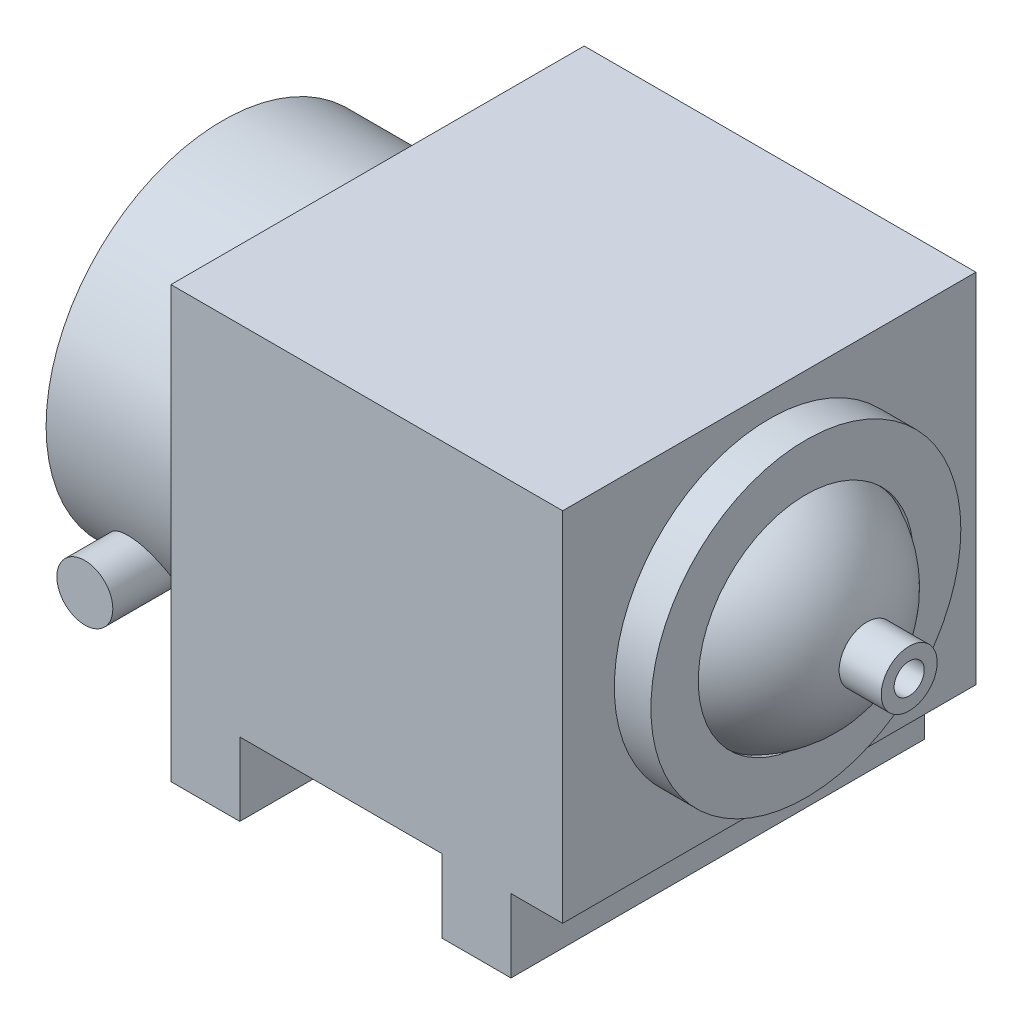
ISO-10303-21;
HEADER;
FILE_DESCRIPTION(('STEP AP214'),'2;1');
FILE_NAME('part.step','',(''),(''),'','','');
FILE_SCHEMA(('AUTOMOTIVE_DESIGN { 1 0 10303 214 1 1 1 1 }'));
ENDSEC;
DATA;
#1=APPLICATION_CONTEXT('core data for automotive mechanical design processes');
#2=APPLICATION_PROTOCOL_DEFINITION('international standard','automotive_design',2000,#1);
#3=PRODUCT_CONTEXT('',#1,'mechanical');
#4=PRODUCT('Part','Part','',(#3));
#5=PRODUCT_RELATED_PRODUCT_CATEGORY('part','',(#4));
#6=PRODUCT_DEFINITION_FORMATION('','',#4);
#7=PRODUCT_DEFINITION_CONTEXT('part definition',#1,'design');
#8=PRODUCT_DEFINITION('design','',#6,#7);
#9=PRODUCT_DEFINITION_SHAPE('','',#8);
#10=(LENGTH_UNIT() NAMED_UNIT(*) SI_UNIT(.MILLI.,.METRE.));
#11=(NAMED_UNIT(*) PLANE_ANGLE_UNIT() SI_UNIT($,.RADIAN.));
#12=(NAMED_UNIT(*) SI_UNIT($,.STERADIAN.) SOLID_ANGLE_UNIT());
#13=UNCERTAINTY_MEASURE_WITH_UNIT(LENGTH_MEASURE(1.E-05),#10,'distance_accuracy_value','');
#14=(GEOMETRIC_REPRESENTATION_CONTEXT(3) GLOBAL_UNCERTAINTY_ASSIGNED_CONTEXT((#13)) GLOBAL_UNIT_ASSIGNED_CONTEXT((#10,
#11,#12)) REPRESENTATION_CONTEXT('',''));
#15=CARTESIAN_POINT('',(0.,0.,0.));
#16=DIRECTION('',(0.,0.,1.));
#17=DIRECTION('',(1.,0.,0.));
#18=AXIS2_PLACEMENT_3D('',#15,#16,#17);
#19=CARTESIAN_POINT('',(47.46875,58.5,0.));
#20=DIRECTION('',(0.,0.,1.));
#21=DIRECTION('',(1.,0.,0.));
#22=AXIS2_PLACEMENT_3D('',#19,#20,#21);
#23=SPHERICAL_SURFACE('',#22,27.53125);
#24=CARTESIAN_POINT('',(47.46875,58.5,0.));
#25=DIRECTION('',(1.,0.,0.));
#26=DIRECTION('',(0.,0.,-1.));
#27=AXIS2_PLACEMENT_3D('',#24,#25,#26);
#28=SPHERICAL_SURFACE('',#27,27.53125);
#29=CARTESIAN_POINT('',(59.,58.5,0.));
#30=DIRECTION('',(1.,0.,0.));
#31=DIRECTION('',(0.,0.,-1.));
#32=AXIS2_PLACEMENT_3D('',#29,#30,#31);
#33=CIRCLE('',#32,25.);
#34=CARTESIAN_POINT('',(59.,58.5,-25.));
#35=VERTEX_POINT('',#34);
#36=EDGE_CURVE('E200',#35,#35,#33,.T.);
#37=ORIENTED_EDGE('',*,*,#36,.T.);
#38=EDGE_LOOP('',(#37));
#39=FACE_BOUND('',#38,.T.);
#40=CARTESIAN_POINT('',(74.2216886528378,58.5,0.));
#41=DIRECTION('',(-1.,0.,0.));
#42=DIRECTION('',(0.,0.,1.));
#43=AXIS2_PLACEMENT_3D('',#40,#41,#42);
#44=CIRCLE('',#43,6.5);
#45=CARTESIAN_POINT('',(74.2216886528378,58.5,6.5));
#46=VERTEX_POINT('',#45);
#47=EDGE_CURVE('E37',#46,#46,#44,.T.);
#48=ORIENTED_EDGE('',*,*,#47,.T.);
#49=EDGE_LOOP('',(#48));
#50=FACE_BOUND('',#49,.T.);
#51=ADVANCED_FACE('F33',(#39,#50),#28,.T.);
#52=CARTESIAN_POINT('',(0.,0.,0.));
#53=DIRECTION('',(0.,-1.,0.));
#54=DIRECTION('',(0.,0.,-1.));
#55=AXIS2_PLACEMENT_3D('',#52,#53,#54);
#56=PLANE('',#55);
#57=CARTESIAN_POINT('',(32.,0.,-40.5));
#58=DIRECTION('',(0.,1.,0.));
#59=DIRECTION('',(0.,0.,1.));
#60=AXIS2_PLACEMENT_3D('',#57,#58,#59);
#61=CIRCLE('',#60,2.99999999999999);
#62=CARTESIAN_POINT('',(32.,0.,-37.5));
#63=VERTEX_POINT('',#62);
#64=EDGE_CURVE('E173',#63,#63,#61,.T.);
#65=ORIENTED_EDGE('',*,*,#64,.T.);
#66=EDGE_LOOP('',(#65));
#67=FACE_BOUND('',#66,.T.);
#68=DIRECTION('',(1.,0.,0.));
#69=VECTOR('',#68,1.);
#70=CARTESIAN_POINT('',(23.5,0.,48.));
#71=LINE('',#70,#69);
#72=CARTESIAN_POINT('',(23.5,0.,48.));
#73=VERTEX_POINT('',#72);
#74=CARTESIAN_POINT('',(39.5,0.,48.));
#75=VERTEX_POINT('',#74);
#76=EDGE_CURVE('E178',#73,#75,#71,.T.);
#77=ORIENTED_EDGE('',*,*,#76,.F.);
#78=DIRECTION('',(0.,0.,1.));
#79=VECTOR('',#78,1.);
#80=CARTESIAN_POINT('',(23.5,0.,48.));
#81=LINE('',#80,#79);
#82=CARTESIAN_POINT('',(23.5,0.,-48.));
#83=VERTEX_POINT('',#82);
#84=EDGE_CURVE('E72',#83,#73,#81,.T.);
#85=ORIENTED_EDGE('',*,*,#84,.F.);
#86=DIRECTION('',(-1.,0.,0.));
#87=VECTOR('',#86,1.);
#88=CARTESIAN_POINT('',(23.5,0.,-48.));
#89=LINE('',#88,#87);
#90=CARTESIAN_POINT('',(39.5,0.,-48.));
#91=VERTEX_POINT('',#90);
#92=EDGE_CURVE('E67',#91,#83,#89,.T.);
#93=ORIENTED_EDGE('',*,*,#92,.F.);
#94=DIRECTION('',(0.,0.,-1.));
#95=VECTOR('',#94,1.);
#96=CARTESIAN_POINT('',(39.5,0.,-48.));
#97=LINE('',#96,#95);
#98=EDGE_CURVE('E183',#75,#91,#97,.T.);
#99=ORIENTED_EDGE('',*,*,#98,.F.);
#100=EDGE_LOOP('',(#77,#85,#93,#99));
#101=FACE_BOUND('',#100,.T.);
#102=CARTESIAN_POINT('',(32.,0.,40.5));
#103=DIRECTION('',(0.,1.,0.));
#104=DIRECTION('',(0.,0.,1.));
#105=AXIS2_PLACEMENT_3D('',#102,#103,#104);
#106=CIRCLE('',#105,2.99999999999999);
#107=CARTESIAN_POINT('',(32.,0.,43.5));
#108=VERTEX_POINT('',#107);
#109=EDGE_CURVE('E170',#108,#108,#106,.T.);
#110=ORIENTED_EDGE('',*,*,#109,.T.);
#111=EDGE_LOOP('',(#110));
#112=FACE_BOUND('',#111,.T.);
#113=ADVANCED_FACE('F287',(#67,#101,#112),#56,.T.);
#114=CARTESIAN_POINT('',(23.5,17.,48.));
#115=DIRECTION('',(0.,0.,-1.));
#116=DIRECTION('',(-1.,0.,0.));
#117=AXIS2_PLACEMENT_3D('',#114,#115,#116);
#118=PLANE('',#117);
#119=ORIENTED_EDGE('',*,*,#76,.T.);
#120=DIRECTION('',(0.,-1.,0.));
#121=VECTOR('',#120,1.);
#122=CARTESIAN_POINT('',(39.5,17.,48.));
#123=LINE('',#122,#121);
#124=CARTESIAN_POINT('',(39.5,17.,48.));
#125=VERTEX_POINT('',#124);
#126=EDGE_CURVE('E191',#125,#75,#123,.T.);
#127=ORIENTED_EDGE('',*,*,#126,.F.);
#128=DIRECTION('',(1.,0.,0.));
#129=VECTOR('',#128,1.);
#130=CARTESIAN_POINT('',(-39.5,17.,48.));
#131=LINE('',#130,#129);
#132=CARTESIAN_POINT('',(51.5,17.,48.));
#133=VERTEX_POINT('',#132);
#134=EDGE_CURVE('E130',#125,#133,#131,.T.);
#135=ORIENTED_EDGE('',*,*,#134,.T.);
#136=DIRECTION('',(0.,-1.,0.));
#137=VECTOR('',#136,1.);
#138=CARTESIAN_POINT('',(51.5,100.,48.));
#139=LINE('',#138,#137);
#140=CARTESIAN_POINT('',(51.5,100.,48.));
#141=VERTEX_POINT('',#140);
#142=EDGE_CURVE('E161',#141,#133,#139,.T.);
#143=ORIENTED_EDGE('',*,*,#142,.F.);
#144=DIRECTION('',(1.,0.,0.));
#145=VECTOR('',#144,1.);
#146=CARTESIAN_POINT('',(-39.5,100.,48.));
#147=LINE('',#146,#145);
#148=CARTESIAN_POINT('',(-39.5,100.,48.));
#149=VERTEX_POINT('',#148);
#150=EDGE_CURVE('E378',#149,#141,#147,.T.);
#151=ORIENTED_EDGE('',*,*,#150,.F.);
#152=DIRECTION('',(0.,-1.,0.));
#153=VECTOR('',#152,1.);
#154=CARTESIAN_POINT('',(-39.5,100.,48.));
#155=LINE('',#154,#153);
#156=CARTESIAN_POINT('',(-39.5,0.,48.));
#157=VERTEX_POINT('',#156);
#158=EDGE_CURVE('E164',#149,#157,#155,.T.);
#159=ORIENTED_EDGE('',*,*,#158,.T.);
#160=DIRECTION('',(1.,0.,0.));
#161=VECTOR('',#160,1.);
#162=CARTESIAN_POINT('',(-39.5,0.,48.));
#163=LINE('',#162,#161);
#164=CARTESIAN_POINT('',(-23.5,0.,48.));
#165=VERTEX_POINT('',#164);
#166=EDGE_CURVE('E127',#157,#165,#163,.T.);
#167=ORIENTED_EDGE('',*,*,#166,.T.);
#168=DIRECTION('',(0.,-1.,0.));
#169=VECTOR('',#168,1.);
#170=CARTESIAN_POINT('',(-23.5,17.,48.));
#171=LINE('',#170,#169);
#172=CARTESIAN_POINT('',(-23.5,17.,48.));
#173=VERTEX_POINT('',#172);
#174=EDGE_CURVE('E120',#173,#165,#171,.T.);
#175=ORIENTED_EDGE('',*,*,#174,.F.);
#176=CARTESIAN_POINT('',(23.5,17.,48.));
#177=VERTEX_POINT('',#176);
#178=EDGE_CURVE('E125',#173,#177,#131,.T.);
#179=ORIENTED_EDGE('',*,*,#178,.T.);
#180=DIRECTION('',(0.,-1.,0.));
#181=VECTOR('',#180,1.);
#182=CARTESIAN_POINT('',(23.5,17.,48.));
#183=LINE('',#182,#181);
#184=EDGE_CURVE('E181',#177,#73,#183,.T.);
#185=ORIENTED_EDGE('',*,*,#184,.T.);
#186=EDGE_LOOP('',(#119,#127,#135,#143,#151,#159,#167,#175,#179,#185));
#187=FACE_BOUND('',#186,.T.);
#188=ADVANCED_FACE('F123',(#187),#118,.F.);
#189=CARTESIAN_POINT('',(39.5,17.,-48.));
#190=DIRECTION('',(-1.,0.,0.));
#191=DIRECTION('',(0.,0.,1.));
#192=AXIS2_PLACEMENT_3D('',#189,#190,#191);
#193=PLANE('',#192);
#194=ORIENTED_EDGE('',*,*,#98,.T.);
#195=DIRECTION('',(0.,-1.,0.));
#196=VECTOR('',#195,1.);
#197=CARTESIAN_POINT('',(39.5,17.,-48.));
#198=LINE('',#197,#196);
#199=CARTESIAN_POINT('',(39.5,17.,-48.));
#200=VERTEX_POINT('',#199);
#201=EDGE_CURVE('E189',#200,#91,#198,.T.);
#202=ORIENTED_EDGE('',*,*,#201,.F.);
#203=DIRECTION('',(0.,0.,-1.));
#204=VECTOR('',#203,1.);
#205=CARTESIAN_POINT('',(39.5,17.,-48.));
#206=LINE('',#205,#204);
#207=EDGE_CURVE('E78',#125,#200,#206,.T.);
#208=ORIENTED_EDGE('',*,*,#207,.F.);
#209=ORIENTED_EDGE('',*,*,#126,.T.);
#210=EDGE_LOOP('',(#194,#202,#208,#209));
#211=FACE_BOUND('',#210,.T.);
#212=ADVANCED_FACE('F296',(#211),#193,.F.);
#213=CARTESIAN_POINT('',(23.5,17.,-48.));
#214=DIRECTION('',(0.,0.,1.));
#215=DIRECTION('',(1.,0.,0.));
#216=AXIS2_PLACEMENT_3D('',#213,#214,#215);
#217=PLANE('',#216);
#218=ORIENTED_EDGE('',*,*,#92,.T.);
#219=DIRECTION('',(0.,-1.,0.));
#220=VECTOR('',#219,1.);
#221=CARTESIAN_POINT('',(23.5,17.,-48.));
#222=LINE('',#221,#220);
#223=CARTESIAN_POINT('',(23.5,17.,-48.));
#224=VERTEX_POINT('',#223);
#225=EDGE_CURVE('E51',#224,#83,#222,.T.);
#226=ORIENTED_EDGE('',*,*,#225,.F.);
#227=DIRECTION('',(-1.,0.,0.));
#228=VECTOR('',#227,1.);
#229=CARTESIAN_POINT('',(-39.5,17.,-48.));
#230=LINE('',#229,#228);
#231=CARTESIAN_POINT('',(-23.5,17.,-48.));
#232=VERTEX_POINT('',#231);
#233=EDGE_CURVE('E146',#224,#232,#230,.T.);
#234=ORIENTED_EDGE('',*,*,#233,.T.);
#235=DIRECTION('',(0.,-1.,0.));
#236=VECTOR('',#235,1.);
#237=CARTESIAN_POINT('',(-23.5,17.,-48.));
#238=LINE('',#237,#236);
#239=CARTESIAN_POINT('',(-23.5,0.,-48.));
#240=VERTEX_POINT('',#239);
#241=EDGE_CURVE('E131',#232,#240,#238,.T.);
#242=ORIENTED_EDGE('',*,*,#241,.T.);
#243=DIRECTION('',(-1.,0.,0.));
#244=VECTOR('',#243,1.);
#245=CARTESIAN_POINT('',(-39.5,0.,-48.));
#246=LINE('',#245,#244);
#247=CARTESIAN_POINT('',(-39.5,0.,-48.));
#248=VERTEX_POINT('',#247);
#249=EDGE_CURVE('E139',#240,#248,#246,.T.);
#250=ORIENTED_EDGE('',*,*,#249,.T.);
#251=DIRECTION('',(0.,-1.,0.));
#252=VECTOR('',#251,1.);
#253=CARTESIAN_POINT('',(-39.5,100.,-48.));
#254=LINE('',#253,#252);
#255=CARTESIAN_POINT('',(-39.5,100.,-48.));
#256=VERTEX_POINT('',#255);
#257=EDGE_CURVE('E156',#256,#248,#254,.T.);
#258=ORIENTED_EDGE('',*,*,#257,.F.);
#259=DIRECTION('',(-1.,0.,0.));
#260=VECTOR('',#259,1.);
#261=CARTESIAN_POINT('',(-39.5,100.,-48.));
#262=LINE('',#261,#260);
#263=CARTESIAN_POINT('',(51.5,100.,-48.));
#264=VERTEX_POINT('',#263);
#265=EDGE_CURVE('E149',#264,#256,#262,.T.);
#266=ORIENTED_EDGE('',*,*,#265,.F.);
#267=DIRECTION('',(0.,-1.,0.));
#268=VECTOR('',#267,1.);
#269=CARTESIAN_POINT('',(51.5,100.,-48.));
#270=LINE('',#269,#268);
#271=CARTESIAN_POINT('',(51.5,17.,-48.));
#272=VERTEX_POINT('',#271);
#273=EDGE_CURVE('E158',#264,#272,#270,.T.);
#274=ORIENTED_EDGE('',*,*,#273,.T.);
#275=EDGE_CURVE('E152',#272,#200,#230,.T.);
#276=ORIENTED_EDGE('',*,*,#275,.T.);
#277=ORIENTED_EDGE('',*,*,#201,.T.);
#278=EDGE_LOOP('',(#218,#226,#234,#242,#250,#258,#266,#274,#276,#277));
#279=FACE_BOUND('',#278,.T.);
#280=ADVANCED_FACE('F293',(#279),#217,.F.);
#281=CARTESIAN_POINT('',(23.5,17.,48.));
#282=DIRECTION('',(1.,0.,0.));
#283=DIRECTION('',(0.,0.,-1.));
#284=AXIS2_PLACEMENT_3D('',#281,#282,#283);
#285=PLANE('',#284);
#286=ORIENTED_EDGE('',*,*,#84,.T.);
#287=ORIENTED_EDGE('',*,*,#184,.F.);
#288=DIRECTION('',(0.,0.,1.));
#289=VECTOR('',#288,1.);
#290=CARTESIAN_POINT('',(23.5,17.,48.));
#291=LINE('',#290,#289);
#292=EDGE_CURVE('E143',#224,#177,#291,.T.);
#293=ORIENTED_EDGE('',*,*,#292,.F.);
#294=ORIENTED_EDGE('',*,*,#225,.T.);
#295=EDGE_LOOP('',(#286,#287,#293,#294));
#296=FACE_BOUND('',#295,.T.);
#297=ADVANCED_FACE('F285',(#296),#285,.F.);
#298=CARTESIAN_POINT('',(32.,17.,-40.5));
#299=DIRECTION('',(0.,-1.,0.));
#300=DIRECTION('',(0.,0.,-1.));
#301=AXIS2_PLACEMENT_3D('',#298,#299,#300);
#302=CYLINDRICAL_SURFACE('',#301,2.99999999999999);
#303=CARTESIAN_POINT('',(32.,17.,-40.5));
#304=DIRECTION('',(0.,1.,0.));
#305=DIRECTION('',(0.,0.,1.));
#306=AXIS2_PLACEMENT_3D('',#303,#304,#305);
#307=CIRCLE('',#306,2.99999999999999);
#308=CARTESIAN_POINT('',(32.,17.,-37.5));
#309=VERTEX_POINT('',#308);
#310=EDGE_CURVE('E169',#309,#309,#307,.T.);
#311=ORIENTED_EDGE('',*,*,#310,.T.);
#312=EDGE_LOOP('',(#311));
#313=FACE_BOUND('',#312,.T.);
#314=ORIENTED_EDGE('',*,*,#64,.F.);
#315=EDGE_LOOP('',(#314));
#316=FACE_BOUND('',#315,.T.);
#317=ADVANCED_FACE('F281',(#313,#316),#302,.F.);
#318=CARTESIAN_POINT('',(32.,17.,40.5));
#319=DIRECTION('',(0.,-1.,0.));
#320=DIRECTION('',(0.,0.,-1.));
#321=AXIS2_PLACEMENT_3D('',#318,#319,#320);
#322=CYLINDRICAL_SURFACE('',#321,2.99999999999999);
#323=CARTESIAN_POINT('',(32.,17.,40.5));
#324=DIRECTION('',(0.,1.,0.));
#325=DIRECTION('',(0.,0.,1.));
#326=AXIS2_PLACEMENT_3D('',#323,#324,#325);
#327=CIRCLE('',#326,2.99999999999999);
#328=CARTESIAN_POINT('',(32.,17.,43.5));
#329=VERTEX_POINT('',#328);
#330=EDGE_CURVE('E166',#329,#329,#327,.T.);
#331=ORIENTED_EDGE('',*,*,#330,.T.);
#332=EDGE_LOOP('',(#331));
#333=FACE_BOUND('',#332,.T.);
#334=ORIENTED_EDGE('',*,*,#109,.F.);
#335=EDGE_LOOP('',(#334));
#336=FACE_BOUND('',#335,.T.);
#337=ADVANCED_FACE('F278',(#333,#336),#322,.F.);
#338=CARTESIAN_POINT('',(0.,17.,0.));
#339=DIRECTION('',(0.,-1.,0.));
#340=DIRECTION('',(0.,0.,-1.));
#341=AXIS2_PLACEMENT_3D('',#338,#339,#340);
#342=PLANE('',#341);
#343=ORIENTED_EDGE('',*,*,#330,.F.);
#344=EDGE_LOOP('',(#343));
#345=FACE_BOUND('',#344,.T.);
#346=ADVANCED_FACE('F269',(#345),#342,.T.);
#347=ORIENTED_EDGE('',*,*,#310,.F.);
#348=EDGE_LOOP('',(#347));
#349=FACE_BOUND('',#348,.T.);
#350=ADVANCED_FACE('F402',(#349),#342,.T.);
#351=ORIENTED_EDGE('',*,*,#134,.F.);
#352=ORIENTED_EDGE('',*,*,#207,.T.);
#353=ORIENTED_EDGE('',*,*,#275,.F.);
#354=DIRECTION('',(0.,0.,-1.));
#355=VECTOR('',#354,1.);
#356=CARTESIAN_POINT('',(51.5,17.,48.));
#357=LINE('',#356,#355);
#358=EDGE_CURVE('E144',#133,#272,#357,.T.);
#359=ORIENTED_EDGE('',*,*,#358,.F.);
#360=EDGE_LOOP('',(#351,#352,#353,#359));
#361=FACE_BOUND('',#360,.T.);
#362=ADVANCED_FACE('F276',(#361),#342,.T.);
#363=CARTESIAN_POINT('',(-39.5,100.,48.));
#364=DIRECTION('',(1.,0.,0.));
#365=DIRECTION('',(0.,0.,-1.));
#366=AXIS2_PLACEMENT_3D('',#363,#364,#365);
#367=PLANE('',#366);
#368=CARTESIAN_POINT('',(-39.5,50.,0.));
#369=DIRECTION('',(-1.,0.,0.));
#370=DIRECTION('',(0.,0.,1.));
#371=AXIS2_PLACEMENT_3D('',#368,#369,#370);
#372=CIRCLE('',#371,41.);
#373=CARTESIAN_POINT('',(-39.5,50.,41.));
#374=VERTEX_POINT('',#373);
#375=EDGE_CURVE('E199',#374,#374,#372,.T.);
#376=ORIENTED_EDGE('',*,*,#375,.F.);
#377=EDGE_LOOP('',(#376));
#378=FACE_BOUND('',#377,.T.);
#379=ORIENTED_EDGE('',*,*,#257,.T.);
#380=DIRECTION('',(0.,0.,1.));
#381=VECTOR('',#380,1.);
#382=CARTESIAN_POINT('',(-39.5,0.,-48.));
#383=LINE('',#382,#381);
#384=EDGE_CURVE('E366',#248,#157,#383,.T.);
#385=ORIENTED_EDGE('',*,*,#384,.T.);
#386=ORIENTED_EDGE('',*,*,#158,.F.);
#387=DIRECTION('',(0.,0.,1.));
#388=VECTOR('',#387,1.);
#389=CARTESIAN_POINT('',(-39.5,100.,48.));
#390=LINE('',#389,#388);
#391=EDGE_CURVE('E155',#256,#149,#390,.T.);
#392=ORIENTED_EDGE('',*,*,#391,.F.);
#393=EDGE_LOOP('',(#379,#385,#386,#392));
#394=FACE_BOUND('',#393,.T.);
#395=ADVANCED_FACE('F272',(#378,#394),#367,.F.);
#396=CARTESIAN_POINT('',(51.5,100.,48.));
#397=DIRECTION('',(-1.,0.,0.));
#398=DIRECTION('',(0.,0.,1.));
#399=AXIS2_PLACEMENT_3D('',#396,#397,#398);
#400=PLANE('',#399);
#401=CARTESIAN_POINT('',(51.5,58.5,0.));
#402=DIRECTION('',(1.,0.,0.));
#403=DIRECTION('',(0.,0.,-1.));
#404=AXIS2_PLACEMENT_3D('',#401,#402,#403);
#405=CIRCLE('',#404,36.);
#406=CARTESIAN_POINT('',(51.5,58.5,-36.));
#407=VERTEX_POINT('',#406);
#408=EDGE_CURVE('E43',#407,#407,#405,.T.);
#409=ORIENTED_EDGE('',*,*,#408,.F.);
#410=EDGE_LOOP('',(#409));
#411=FACE_BOUND('',#410,.T.);
#412=ORIENTED_EDGE('',*,*,#358,.T.);
#413=ORIENTED_EDGE('',*,*,#273,.F.);
#414=DIRECTION('',(0.,0.,-1.));
#415=VECTOR('',#414,1.);
#416=CARTESIAN_POINT('',(51.5,100.,48.));
#417=LINE('',#416,#415);
#418=EDGE_CURVE('E379',#141,#264,#417,.T.);
#419=ORIENTED_EDGE('',*,*,#418,.F.);
#420=ORIENTED_EDGE('',*,*,#142,.T.);
#421=EDGE_LOOP('',(#412,#413,#419,#420));
#422=FACE_BOUND('',#421,.T.);
#423=ADVANCED_FACE('F265',(#411,#422),#400,.F.);
#424=CARTESIAN_POINT('',(0.,100.,0.));
#425=DIRECTION('',(0.,-1.,0.));
#426=DIRECTION('',(0.,0.,-1.));
#427=AXIS2_PLACEMENT_3D('',#424,#425,#426);
#428=PLANE('',#427);
#429=ORIENTED_EDGE('',*,*,#391,.T.);
#430=ORIENTED_EDGE('',*,*,#150,.T.);
#431=ORIENTED_EDGE('',*,*,#418,.T.);
#432=ORIENTED_EDGE('',*,*,#265,.T.);
#433=EDGE_LOOP('',(#429,#430,#431,#432));
#434=FACE_BOUND('',#433,.T.);
#435=ADVANCED_FACE('F262',(#434),#428,.F.);
#436=ORIENTED_EDGE('',*,*,#178,.F.);
#437=DIRECTION('',(0.,0.,-1.));
#438=VECTOR('',#437,1.);
#439=CARTESIAN_POINT('',(-23.5,17.,-48.));
#440=LINE('',#439,#438);
#441=EDGE_CURVE('E134',#173,#232,#440,.T.);
#442=ORIENTED_EDGE('',*,*,#441,.T.);
#443=ORIENTED_EDGE('',*,*,#233,.F.);
#444=ORIENTED_EDGE('',*,*,#292,.T.);
#445=EDGE_LOOP('',(#436,#442,#443,#444));
#446=FACE_BOUND('',#445,.T.);
#447=ADVANCED_FACE('F142',(#446),#342,.T.);
#448=CARTESIAN_POINT('',(0.,0.,0.));
#449=DIRECTION('',(0.,1.,0.));
#450=DIRECTION('',(0.,0.,1.));
#451=AXIS2_PLACEMENT_3D('',#448,#449,#450);
#452=PLANE('',#451);
#453=ORIENTED_EDGE('',*,*,#384,.F.);
#454=ORIENTED_EDGE('',*,*,#249,.F.);
#455=DIRECTION('',(0.,0.,-1.));
#456=VECTOR('',#455,1.);
#457=CARTESIAN_POINT('',(-23.5,0.,-48.));
#458=LINE('',#457,#456);
#459=EDGE_CURVE('E371',#165,#240,#458,.T.);
#460=ORIENTED_EDGE('',*,*,#459,.F.);
#461=ORIENTED_EDGE('',*,*,#166,.F.);
#462=EDGE_LOOP('',(#453,#454,#460,#461));
#463=FACE_BOUND('',#462,.T.);
#464=CARTESIAN_POINT('',(-32.,0.,-40.5));
#465=DIRECTION('',(0.,1.,0.));
#466=DIRECTION('',(0.,0.,1.));
#467=AXIS2_PLACEMENT_3D('',#464,#465,#466);
#468=CIRCLE('',#467,3.);
#469=CARTESIAN_POINT('',(-32.,0.,-37.5));
#470=VERTEX_POINT('',#469);
#471=EDGE_CURVE('E364',#470,#470,#468,.T.);
#472=ORIENTED_EDGE('',*,*,#471,.T.);
#473=EDGE_LOOP('',(#472));
#474=FACE_BOUND('',#473,.T.);
#475=CARTESIAN_POINT('',(-32.,0.,40.5));
#476=DIRECTION('',(0.,1.,0.));
#477=DIRECTION('',(0.,0.,1.));
#478=AXIS2_PLACEMENT_3D('',#475,#476,#477);
#479=CIRCLE('',#478,2.99999999999999);
#480=CARTESIAN_POINT('',(-32.,0.,43.5));
#481=VERTEX_POINT('',#480);
#482=EDGE_CURVE('E361',#481,#481,#479,.T.);
#483=ORIENTED_EDGE('',*,*,#482,.T.);
#484=EDGE_LOOP('',(#483));
#485=FACE_BOUND('',#484,.T.);
#486=ADVANCED_FACE('F256',(#463,#474,#485),#452,.F.);
#487=CARTESIAN_POINT('',(-23.5,17.,-48.));
#488=DIRECTION('',(-1.,0.,0.));
#489=DIRECTION('',(0.,0.,1.));
#490=AXIS2_PLACEMENT_3D('',#487,#488,#489);
#491=PLANE('',#490);
#492=ORIENTED_EDGE('',*,*,#459,.T.);
#493=ORIENTED_EDGE('',*,*,#241,.F.);
#494=ORIENTED_EDGE('',*,*,#441,.F.);
#495=ORIENTED_EDGE('',*,*,#174,.T.);
#496=EDGE_LOOP('',(#492,#493,#494,#495));
#497=FACE_BOUND('',#496,.T.);
#498=ADVANCED_FACE('F135',(#497),#491,.F.);
#499=CARTESIAN_POINT('',(-32.,17.,-40.5));
#500=DIRECTION('',(0.,-1.,0.));
#501=DIRECTION('',(0.,0.,-1.));
#502=AXIS2_PLACEMENT_3D('',#499,#500,#501);
#503=CYLINDRICAL_SURFACE('',#502,3.);
#504=CARTESIAN_POINT('',(-32.,17.,-40.5));
#505=DIRECTION('',(0.,-1.,0.));
#506=DIRECTION('',(0.,0.,-1.));
#507=AXIS2_PLACEMENT_3D('',#504,#505,#506);
#508=CIRCLE('',#507,3.);
#509=CARTESIAN_POINT('',(-32.,17.,-43.5));
#510=VERTEX_POINT('',#509);
#511=EDGE_CURVE('E196',#510,#510,#508,.F.);
#512=ORIENTED_EDGE('',*,*,#511,.T.);
#513=EDGE_LOOP('',(#512));
#514=FACE_BOUND('',#513,.T.);
#515=ORIENTED_EDGE('',*,*,#471,.F.);
#516=EDGE_LOOP('',(#515));
#517=FACE_BOUND('',#516,.T.);
#518=ADVANCED_FACE('F251',(#514,#517),#503,.F.);
#519=CARTESIAN_POINT('',(-32.,17.,40.5));
#520=DIRECTION('',(0.,-1.,0.));
#521=DIRECTION('',(0.,0.,-1.));
#522=AXIS2_PLACEMENT_3D('',#519,#520,#521);
#523=CYLINDRICAL_SURFACE('',#522,2.99999999999999);
#524=CARTESIAN_POINT('',(-32.,17.,40.5));
#525=DIRECTION('',(0.,-1.,0.));
#526=DIRECTION('',(0.,0.,-1.));
#527=AXIS2_PLACEMENT_3D('',#524,#525,#526);
#528=CIRCLE('',#527,2.99999999999999);
#529=CARTESIAN_POINT('',(-32.,17.,37.5));
#530=VERTEX_POINT('',#529);
#531=EDGE_CURVE('E193',#530,#530,#528,.F.);
#532=ORIENTED_EDGE('',*,*,#531,.T.);
#533=EDGE_LOOP('',(#532));
#534=FACE_BOUND('',#533,.T.);
#535=ORIENTED_EDGE('',*,*,#482,.F.);
#536=EDGE_LOOP('',(#535));
#537=FACE_BOUND('',#536,.T.);
#538=ADVANCED_FACE('F247',(#534,#537),#523,.F.);
#539=ORIENTED_EDGE('',*,*,#531,.F.);
#540=EDGE_LOOP('',(#539));
#541=FACE_BOUND('',#540,.T.);
#542=ADVANCED_FACE('F250',(#541),#342,.T.);
#543=ORIENTED_EDGE('',*,*,#511,.F.);
#544=EDGE_LOOP('',(#543));
#545=FACE_BOUND('',#544,.T.);
#546=ADVANCED_FACE('F245',(#545),#342,.T.);
#547=CARTESIAN_POINT('',(-75.5,50.,0.));
#548=DIRECTION('',(1.,0.,0.));
#549=DIRECTION('',(0.,0.,-1.));
#550=AXIS2_PLACEMENT_3D('',#547,#548,#549);
#551=CYLINDRICAL_SURFACE('',#550,41.);
#552=CARTESIAN_POINT('',(-53.,28.,34.5976877840124));
#553=CARTESIAN_POINT('',(-53.000000469284,28.1936269053041,34.7208107303923));
#554=CARTESIAN_POINT('',(-53.0086545099493,28.3883444351911,34.8423404504152));
#555=CARTESIAN_POINT('',(-53.0438293676719,28.778628685334,35.0814166593694));
#556=CARTESIAN_POINT('',(-53.0703526115214,28.9741955173478,35.198962604992));
#557=CARTESIAN_POINT('',(-53.141879228148,29.365245797567,35.4296282791066));
#558=CARTESIAN_POINT('',(-53.1869271504804,29.5607278996213,35.5427366123913));
#559=CARTESIAN_POINT('',(-53.295922886037,29.9493941506098,35.7634327113673));
#560=CARTESIAN_POINT('',(-53.3598599410834,30.1425795426457,35.8710235786698));
#561=CARTESIAN_POINT('',(-53.5074239990105,30.5261678949954,36.0807142303422));
#562=CARTESIAN_POINT('',(-53.5911736512392,30.7165453426874,36.1827747366887));
#563=CARTESIAN_POINT('',(-53.7782143257903,31.0911102934116,36.379921133852));
#564=CARTESIAN_POINT('',(-53.8814961421089,31.2753006646008,36.4750102812656));
#565=CARTESIAN_POINT('',(-54.1073873946606,31.6352213319213,36.6575448596786));
#566=CARTESIAN_POINT('',(-54.2299814672516,31.8109582092846,36.7449962815422));
#567=CARTESIAN_POINT('',(-54.4940768592214,32.1517688819414,36.9117410973486));
#568=CARTESIAN_POINT('',(-54.6355749050805,32.3168445160714,36.9910358995396));
#569=CARTESIAN_POINT('',(-54.9181120595518,32.6144425532064,37.1317394849983));
#570=CARTESIAN_POINT('',(-55.0570693730091,32.7484721551548,37.1941487141272));
#571=CARTESIAN_POINT('',(-55.3480525018555,33.0048898302218,37.3120106601611));
#572=CARTESIAN_POINT('',(-55.5000765287742,33.1272794917101,37.3674643265424));
#573=CARTESIAN_POINT('',(-55.8160797496596,33.3588325460044,37.4711574782731));
#574=CARTESIAN_POINT('',(-55.9800537007305,33.4680016838736,37.5194000993792));
#575=CARTESIAN_POINT('',(-56.3187295920747,33.6717332611403,37.6085106962819));
#576=CARTESIAN_POINT('',(-56.4934305689642,33.7662970095601,37.6493793330344));
#577=CARTESIAN_POINT('',(-56.8331231750485,33.9303882704231,37.7196856501122));
#578=CARTESIAN_POINT('',(-56.9971943051631,34.0015046567923,37.7498744564152));
#579=CARTESIAN_POINT('',(-57.3315195187013,34.1302341081903,37.8041719333482));
#580=CARTESIAN_POINT('',(-57.5017731114113,34.1878482422245,37.8282810853304));
#581=CARTESIAN_POINT('',(-57.8471183486429,34.2889064011571,37.8703648879262));
#582=CARTESIAN_POINT('',(-58.0222085225229,34.3323546830714,37.8883413815558));
#583=CARTESIAN_POINT('',(-58.3759009313902,34.4046059271504,37.9181383422526));
#584=CARTESIAN_POINT('',(-58.5545030863882,34.4334092224718,37.9299589493594));
#585=CARTESIAN_POINT('',(-58.9043658766264,34.4749215916957,37.9469684336607));
#586=CARTESIAN_POINT('',(-59.0755210634593,34.4883946230962,37.9524722362029));
#587=CARTESIAN_POINT('',(-59.4184469226322,34.5017528587861,37.9579292040047));
#588=CARTESIAN_POINT('',(-59.5902175761435,34.5016384752563,37.9578825376404));
#589=CARTESIAN_POINT('',(-59.9330970832031,34.4878242452546,37.9522391718552));
#590=CARTESIAN_POINT('',(-60.1042060181087,34.4741261258813,37.9466431780014));
#591=CARTESIAN_POINT('',(-60.4445388101189,34.433289938422,37.9299093544057));
#592=CARTESIAN_POINT('',(-60.6137626628955,34.4061518394858,37.9187715119431));
#593=CARTESIAN_POINT('',(-60.9468663966698,34.3391682422377,37.8911551700743));
#594=CARTESIAN_POINT('',(-61.1107874467081,34.2994970057032,37.8747498616856));
#595=CARTESIAN_POINT('',(-61.4345330687638,34.207729003517,37.8365781306826));
#596=CARTESIAN_POINT('',(-61.5943562404854,34.15562805153,37.8148099017528));
#597=CARTESIAN_POINT('',(-61.9087456451382,34.0395379337631,37.7659583766314));
#598=CARTESIAN_POINT('',(-62.0633129571515,33.9755512258998,37.7388761792776));
#599=CARTESIAN_POINT('',(-62.3662375149313,33.8363064464262,37.6794471480134));
#600=CARTESIAN_POINT('',(-62.5145944616905,33.76104783291,37.6471000609828));
#601=CARTESIAN_POINT('',(-62.806735898731,33.5985644389503,37.5766002681342));
#602=CARTESIAN_POINT('',(-62.9503939055629,33.5111523155082,37.5383553779287));
#603=CARTESIAN_POINT('',(-63.2294867543731,33.326251142387,37.4565923891479));
#604=CARTESIAN_POINT('',(-63.3649213642591,33.2287618085043,37.4130741418443));
#605=CARTESIAN_POINT('',(-63.6268205991485,33.0246308199624,37.3208973241709));
#606=CARTESIAN_POINT('',(-63.7532860015662,32.9179899602951,37.272239200217));
#607=CARTESIAN_POINT('',(-63.9966916786627,32.696472614422,37.1699183180607));
#608=CARTESIAN_POINT('',(-64.113628566553,32.5815932269786,37.116253794809));
#609=CARTESIAN_POINT('',(-64.3431613537038,32.3385633583189,37.001251763079));
#610=CARTESIAN_POINT('',(-64.4552306755095,32.2100347543665,36.9396623742566));
#611=CARTESIAN_POINT('',(-64.6678733239411,31.9461141789773,36.8113941653976));
#612=CARTESIAN_POINT('',(-64.7684424260219,31.8107197115965,36.7447134900087));
#613=CARTESIAN_POINT('',(-64.957750971505,31.5342632843823,36.6065627667047));
#614=CARTESIAN_POINT('',(-65.0464918827096,31.3932020305931,36.5350933147031));
#615=CARTESIAN_POINT('',(-65.2120401134653,31.1064485215163,36.3876314787188));
#616=CARTESIAN_POINT('',(-65.2888429323047,30.9607545444867,36.3116374037949));
#617=CARTESIAN_POINT('',(-65.4368878052146,30.6523959487778,36.1483516211248));
#618=CARTESIAN_POINT('',(-65.5069882356401,30.4893932932306,36.0606610825854));
#619=CARTESIAN_POINT('',(-65.6329980009738,30.1604168319309,35.8807217014788));
#620=CARTESIAN_POINT('',(-65.6889020609048,29.9944419462311,35.7884711797143));
#621=CARTESIAN_POINT('',(-65.835547612299,29.4938587712137,35.505556515488));
#622=CARTESIAN_POINT('',(-65.9052972071586,29.1564334427981,35.3086457188078));
#623=CARTESIAN_POINT('',(-65.99641059503,28.4397637365355,34.8762531958956));
#624=CARTESIAN_POINT('',(-66.0104872449372,28.0606620818201,34.6390519183833));
#625=CARTESIAN_POINT('',(-65.9743927505643,27.3125272344827,34.153736719458));
#626=CARTESIAN_POINT('',(-65.9241787410407,26.9435009271214,33.9056156238997));
#627=CARTESIAN_POINT('',(-65.752499520998,26.1747867141687,33.3707428849648));
#628=CARTESIAN_POINT('',(-65.6224554148602,25.7775377154662,33.0832380133348));
#629=CARTESIAN_POINT('',(-65.288300620708,25.0134421564523,32.5099959198927));
#630=CARTESIAN_POINT('',(-65.0841584776996,24.6466085890076,32.2242595012673));
#631=CARTESIAN_POINT('',(-64.7367925317551,24.1449476490221,31.8206867509585));
#632=CARTESIAN_POINT('',(-64.622374799706,23.9940708000536,31.6974412231766));
#633=CARTESIAN_POINT('',(-64.3791386215535,23.7011276196034,31.4548171025958));
#634=CARTESIAN_POINT('',(-64.2503196018344,23.559061639417,31.335438664071));
#635=CARTESIAN_POINT('',(-63.8423131715815,23.1478798050672,30.9853544037261));
#636=CARTESIAN_POINT('',(-63.5411065572725,22.8930911468946,30.7621408534896));
#637=CARTESIAN_POINT('',(-63.0891150984889,22.5786965649177,30.4809032562295));
#638=CARTESIAN_POINT('',(-62.962730040299,22.4970407724529,30.4072092494593));
#639=CARTESIAN_POINT('',(-62.7020927473533,22.3414119687141,30.2657147283755));
#640=CARTESIAN_POINT('',(-62.5678408519421,22.2674386264307,30.1979139601638));
#641=CARTESIAN_POINT('',(-62.2918882415738,22.1280977944272,30.0693543538793));
#642=CARTESIAN_POINT('',(-62.1501945753219,22.0627223595367,30.0085890207915));
#643=CARTESIAN_POINT('',(-61.8597388202094,21.9414213811025,29.8952011914223));
#644=CARTESIAN_POINT('',(-61.7109806361502,21.8854906932506,29.8425742636874));
#645=CARTESIAN_POINT('',(-61.4324995488454,21.7924847743329,29.7546545943641));
#646=CARTESIAN_POINT('',(-61.3037564321689,21.7538204821673,29.7179348405385));
#647=CARTESIAN_POINT('',(-61.0424558431242,21.684218547528,29.6516244570942));
#648=CARTESIAN_POINT('',(-60.9099003072092,21.6532770570703,29.6220302773284));
#649=CARTESIAN_POINT('',(-60.6417058686487,21.599593621903,29.5705648154712));
#650=CARTESIAN_POINT('',(-60.5060680893404,21.5768487392819,29.5486907663103));
#651=CARTESIAN_POINT('',(-60.2325575096124,21.5399381123353,29.5131417646906));
#652=CARTESIAN_POINT('',(-60.0946846898568,21.5257724422718,29.4994668832043));
#653=CARTESIAN_POINT('',(-59.8172494052407,21.506252525818,29.480612980936));
#654=CARTESIAN_POINT('',(-59.6776827318484,21.5009290935311,29.4754636709138));
#655=CARTESIAN_POINT('',(-59.3984467344774,21.4992938197509,29.4738824838196));
#656=CARTESIAN_POINT('',(-59.258777410394,21.5029819874636,29.4774506156532));
#657=CARTESIAN_POINT('',(-58.9804339615966,21.5192986187348,29.4932157590848));
#658=CARTESIAN_POINT('',(-58.8417599994587,21.5319285106562,29.5054141492916));
#659=CARTESIAN_POINT('',(-58.5664862444523,21.5658887290513,29.5381426297413));
#660=CARTESIAN_POINT('',(-58.4298864439318,21.587219023419,29.5586726892392));
#661=CARTESIAN_POINT('',(-58.1663496353294,21.6369457751918,29.6063891360418));
#662=CARTESIAN_POINT('',(-58.0392681520501,21.6649422784301,29.6331977056545));
#663=CARTESIAN_POINT('',(-57.7884710386625,21.7280453327205,29.6934080325199));
#664=CARTESIAN_POINT('',(-57.6647564501907,21.7631540563851,29.7268118043691));
#665=CARTESIAN_POINT('',(-57.2994762304421,21.8784981124636,29.8360913097314));
#666=CARTESIAN_POINT('',(-57.0636644432301,21.9687725640047,29.9210558284039));
#667=CARTESIAN_POINT('',(-56.6746906502407,22.1434227418962,30.0835675440959));
#668=CARTESIAN_POINT('',(-56.5169699658439,22.2222866228008,30.1564530360256));
#669=CARTESIAN_POINT('',(-56.2114923287072,22.3905357285453,30.3105673314134));
#670=CARTESIAN_POINT('',(-56.0637363824455,22.4799220136941,30.3917969755798));
#671=CARTESIAN_POINT('',(-55.7782410348741,22.6682250165441,30.561252380798));
#672=CARTESIAN_POINT('',(-55.6405209637932,22.7671593154372,30.649490992829));
#673=CARTESIAN_POINT('',(-55.3754725036977,22.973423562279,30.8315276515594));
#674=CARTESIAN_POINT('',(-55.2481442733009,23.0807536383292,30.9253257830799));
#675=CARTESIAN_POINT('',(-54.9677439842661,23.3358353570543,31.1457619399905));
#676=CARTESIAN_POINT('',(-54.818189142605,23.4861566079615,31.2739108542251));
#677=CARTESIAN_POINT('',(-54.5364308560824,23.79795877616,31.5356068097497));
#678=CARTESIAN_POINT('',(-54.4042318905832,23.9594425580273,31.6691552330076));
#679=CARTESIAN_POINT('',(-54.1570586897553,24.2924385938073,31.9400594745938));
#680=CARTESIAN_POINT('',(-54.0421016995904,24.4639606526751,32.0774189441378));
#681=CARTESIAN_POINT('',(-53.8296571870629,24.8157529156068,32.3543476332604));
#682=CARTESIAN_POINT('',(-53.7321676468185,24.9960221061195,32.493916595563));
#683=CARTESIAN_POINT('',(-53.5536451314913,25.3667955072155,32.7759090084983));
#684=CARTESIAN_POINT('',(-53.4728512940737,25.557404813038,32.9183455960324));
#685=CARTESIAN_POINT('',(-53.3297287331895,25.9456021906951,33.203070528551));
#686=CARTESIAN_POINT('',(-53.267403305374,26.1431915010653,33.3453588425677));
#687=CARTESIAN_POINT('',(-53.1618665082276,26.5436917055076,33.6282850757277));
#688=CARTESIAN_POINT('',(-53.1186024559992,26.7465862691229,33.7689264845661));
#689=CARTESIAN_POINT('',(-53.0515461517325,27.1570088817551,34.0478963550414));
#690=CARTESIAN_POINT('',(-53.0277419875916,27.3645340161784,34.1862261808006));
#691=CARTESIAN_POINT('',(-53.0093475227486,27.6444015566872,34.3690902872238));
#692=CARTESIAN_POINT('',(-53.0058498394418,27.7152784174739,34.4150886865003));
#693=CARTESIAN_POINT('',(-53.0011756940382,27.8573873884658,34.5066928953005));
#694=CARTESIAN_POINT('',(-52.9999998269988,27.9286195850517,34.5522986012));
#695=CARTESIAN_POINT('',(-53.,28.,34.5976877840124));
#696=B_SPLINE_CURVE_WITH_KNOTS('',3,(#552,#553,#554,#555,#556,#557,#558,#559,#560,#561,#562,
#563,#564,#565,#566,#567,#568,#569,#570,#571,#572,#573,#574,#575,#576,#577,#578,#579,#580,#581,
#582,#583,#584,#585,#586,#587,#588,#589,#590,#591,#592,#593,#594,#595,#596,#597,#598,#599,#600,
#601,#602,#603,#604,#605,#606,#607,#608,#609,#610,#611,#612,#613,#614,#615,#616,#617,#618,#619,
#620,#621,#622,#623,#624,#625,#626,#627,#628,#629,#630,#631,#632,#633,#634,#635,#636,#637,#638,
#639,#640,#641,#642,#643,#644,#645,#646,#647,#648,#649,#650,#651,#652,#653,#654,#655,#656,#657,
#658,#659,#660,#661,#662,#663,#664,#665,#666,#667,#668,#669,#670,#671,#672,#673,#674,#675,#676,
#677,#678,#679,#680,#681,#682,#683,#684,#685,#686,#687,#688,#689,#690,#691,#692,#693,#694,#695),
.UNSPECIFIED.,.T.,.F.,(4,2,2,2,2,2,2,2,2,2,2,2,2,2,2,2,2,2,2,2,2,2,2,2,2,2,2,2,2,2,2,2,2,2,2,2,
2,2,2,2,2,2,2,2,2,2,2,2,2,2,2,2,2,2,2,2,2,2,2,2,2,2,2,2,2,2,2,2,2,2,2,4),(0.,0.688301301547966,
1.37669609920822,2.06675617361524,2.7564239841651,3.45047835630601,4.14420641466019,
4.83738534711566,5.53044439996434,6.13830723215875,6.74608699688356,7.35360169199937,
7.96106190638238,8.50442679758617,9.04774865475654,9.59090708609511,10.134053160654,
10.6487505415451,11.1634323088483,11.6780486455338,12.1926661634757,12.7004219139379,
13.2083489188528,13.7161710036324,14.2240175102098,14.7408048717829,15.2576068120786,
15.7743639032031,16.2913038750135,16.8346406321826,17.3781763443952,17.9216445444006,
18.4653171398703,19.0584525297134,19.6518079907768,20.8379424099079,22.1750236454257,
23.5129968327669,25.0287060518546,26.5450594511679,27.2222681119804,27.8995037562168,
29.2509930373317,29.7533108313618,30.2556069733082,30.7574356413246,31.2589900884635,
31.6766221902082,32.0940457841646,32.5113196117492,32.9285970512238,33.3473256232008,
33.7660546229453,34.1848505261185,34.6036448838834,35.0018041325942,35.4000851932985,
36.1963098546558,36.7680646080663,37.3398770247667,37.9127631991325,38.4856581162118,
39.2279150344975,39.9703631461705,40.7135489610671,41.4566488659169,42.2097497256692,
42.9629848939605,43.7141249651334,44.4648048912239,44.7184816489476,44.9722234129693),.UNSPECIFIED.);
#697=CARTESIAN_POINT('',(-53.,28.,34.5976877840124));
#698=VERTEX_POINT('',#697);
#699=EDGE_CURVE('E222',#698,#698,#696,.T.);
#700=ORIENTED_EDGE('',*,*,#699,.F.);
#701=EDGE_LOOP('',(#700));
#702=FACE_BOUND('',#701,.T.);
#703=CARTESIAN_POINT('',(-75.5,50.,0.));
#704=DIRECTION('',(-1.,0.,0.));
#705=DIRECTION('',(0.,0.,1.));
#706=AXIS2_PLACEMENT_3D('',#703,#704,#705);
#707=CIRCLE('',#706,41.);
#708=CARTESIAN_POINT('',(-75.5,50.,41.));
#709=VERTEX_POINT('',#708);
#710=EDGE_CURVE('E230',#709,#709,#707,.T.);
#711=ORIENTED_EDGE('',*,*,#710,.F.);
#712=EDGE_LOOP('',(#711));
#713=FACE_BOUND('',#712,.T.);
#714=ORIENTED_EDGE('',*,*,#375,.T.);
#715=EDGE_LOOP('',(#714));
#716=FACE_BOUND('',#715,.T.);
#717=ADVANCED_FACE('F241',(#702,#713,#716),#551,.T.);
#718=CARTESIAN_POINT('',(-75.5,50.,0.));
#719=DIRECTION('',(-1.,0.,0.));
#720=DIRECTION('',(0.,0.,1.));
#721=AXIS2_PLACEMENT_3D('',#718,#719,#720);
#722=PLANE('',#721);
#723=ORIENTED_EDGE('',*,*,#710,.T.);
#724=EDGE_LOOP('',(#723));
#725=FACE_BOUND('',#724,.T.);
#726=ADVANCED_FACE('F237',(#725),#722,.T.);
#727=CARTESIAN_POINT('',(-59.5,28.,48.));
#728=DIRECTION('',(0.,0.,1.));
#729=DIRECTION('',(1.,0.,0.));
#730=AXIS2_PLACEMENT_3D('',#727,#728,#729);
#731=PLANE('',#730);
#732=CARTESIAN_POINT('',(-59.5,28.,48.));
#733=DIRECTION('',(0.,0.,1.));
#734=DIRECTION('',(1.,0.,0.));
#735=AXIS2_PLACEMENT_3D('',#732,#733,#734);
#736=CIRCLE('',#735,6.5);
#737=CARTESIAN_POINT('',(-53.,28.,48.));
#738=VERTEX_POINT('',#737);
#739=EDGE_CURVE('E207',#738,#738,#736,.T.);
#740=ORIENTED_EDGE('',*,*,#739,.T.);
#741=EDGE_LOOP('',(#740));
#742=FACE_BOUND('',#741,.T.);
#743=ADVANCED_FACE('F240',(#742),#731,.T.);
#744=CARTESIAN_POINT('',(-59.5,28.,-48.002));
#745=DIRECTION('',(0.,0.,1.));
#746=DIRECTION('',(1.,0.,0.));
#747=AXIS2_PLACEMENT_3D('',#744,#745,#746);
#748=CYLINDRICAL_SURFACE('',#747,6.5);
#749=ORIENTED_EDGE('',*,*,#739,.F.);
#750=EDGE_LOOP('',(#749));
#751=FACE_BOUND('',#750,.T.);
#752=ORIENTED_EDGE('',*,*,#699,.T.);
#753=EDGE_LOOP('',(#752));
#754=FACE_BOUND('',#753,.T.);
#755=ADVANCED_FACE('F232',(#751,#754),#748,.T.);
#756=CARTESIAN_POINT('',(60.,58.5,0.));
#757=DIRECTION('',(-1.,0.,0.));
#758=DIRECTION('',(0.,0.,1.));
#759=AXIS2_PLACEMENT_3D('',#756,#757,#758);
#760=CYLINDRICAL_SURFACE('',#759,36.);
#761=CARTESIAN_POINT('',(60.,58.5,0.));
#762=DIRECTION('',(1.,0.,0.));
#763=DIRECTION('',(0.,0.,-1.));
#764=AXIS2_PLACEMENT_3D('',#761,#762,#763);
#765=CIRCLE('',#764,36.);
#766=CARTESIAN_POINT('',(60.,58.5,-36.));
#767=VERTEX_POINT('',#766);
#768=EDGE_CURVE('E202',#767,#767,#765,.T.);
#769=ORIENTED_EDGE('',*,*,#768,.F.);
#770=EDGE_LOOP('',(#769));
#771=FACE_BOUND('',#770,.T.);
#772=ORIENTED_EDGE('',*,*,#408,.T.);
#773=EDGE_LOOP('',(#772));
#774=FACE_BOUND('',#773,.T.);
#775=ADVANCED_FACE('F341',(#771,#774),#760,.T.);
#776=CARTESIAN_POINT('',(60.,58.5,0.));
#777=DIRECTION('',(1.,0.,0.));
#778=DIRECTION('',(0.,0.,-1.));
#779=AXIS2_PLACEMENT_3D('',#776,#777,#778);
#780=PLANE('',#779);
#781=CARTESIAN_POINT('',(60.,58.5,0.));
#782=DIRECTION('',(1.,0.,0.));
#783=DIRECTION('',(0.,0.,-1.));
#784=AXIS2_PLACEMENT_3D('',#781,#782,#783);
#785=CIRCLE('',#784,25.);
#786=CARTESIAN_POINT('',(60.,58.5,-25.));
#787=VERTEX_POINT('',#786);
#788=EDGE_CURVE('E203',#787,#787,#785,.T.);
#789=ORIENTED_EDGE('',*,*,#788,.F.);
#790=EDGE_LOOP('',(#789));
#791=FACE_BOUND('',#790,.T.);
#792=ORIENTED_EDGE('',*,*,#768,.T.);
#793=EDGE_LOOP('',(#792));
#794=FACE_BOUND('',#793,.T.);
#795=ADVANCED_FACE('F337',(#791,#794),#780,.T.);
#796=CARTESIAN_POINT('',(59.,58.5,0.));
#797=DIRECTION('',(1.,0.,0.));
#798=DIRECTION('',(0.,0.,-1.));
#799=AXIS2_PLACEMENT_3D('',#796,#797,#798);
#800=CYLINDRICAL_SURFACE('',#799,25.);
#801=ORIENTED_EDGE('',*,*,#36,.F.);
#802=EDGE_LOOP('',(#801));
#803=FACE_BOUND('',#802,.T.);
#804=ORIENTED_EDGE('',*,*,#788,.T.);
#805=EDGE_LOOP('',(#804));
#806=FACE_BOUND('',#805,.T.);
#807=ADVANCED_FACE('F331',(#803,#806),#800,.F.);
#808=CARTESIAN_POINT('',(84.,58.5,0.));
#809=DIRECTION('',(1.,0.,0.));
#810=DIRECTION('',(0.,0.,-1.));
#811=AXIS2_PLACEMENT_3D('',#808,#809,#810);
#812=PLANE('',#811);
#813=CARTESIAN_POINT('',(84.,58.5,0.));
#814=DIRECTION('',(1.,0.,0.));
#815=DIRECTION('',(0.,0.,-1.));
#816=AXIS2_PLACEMENT_3D('',#813,#814,#815);
#817=CIRCLE('',#816,6.5);
#818=CARTESIAN_POINT('',(84.,58.5,-6.5));
#819=VERTEX_POINT('',#818);
#820=EDGE_CURVE('E214',#819,#819,#817,.T.);
#821=ORIENTED_EDGE('',*,*,#820,.T.);
#822=EDGE_LOOP('',(#821));
#823=FACE_BOUND('',#822,.T.);
#824=CARTESIAN_POINT('',(84.,58.5,0.));
#825=DIRECTION('',(1.,0.,0.));
#826=DIRECTION('',(0.,0.,-1.));
#827=AXIS2_PLACEMENT_3D('',#824,#825,#826);
#828=CIRCLE('',#827,3.5);
#829=CARTESIAN_POINT('',(84.,58.5,-3.5));
#830=VERTEX_POINT('',#829);
#831=EDGE_CURVE('E318',#830,#830,#828,.T.);
#832=ORIENTED_EDGE('',*,*,#831,.F.);
#833=EDGE_LOOP('',(#832));
#834=FACE_BOUND('',#833,.T.);
#835=ADVANCED_FACE('F323',(#823,#834),#812,.T.);
#836=CARTESIAN_POINT('',(84.,58.5,0.));
#837=DIRECTION('',(-1.,0.,0.));
#838=DIRECTION('',(0.,0.,1.));
#839=AXIS2_PLACEMENT_3D('',#836,#837,#838);
#840=CYLINDRICAL_SURFACE('',#839,6.5);
#841=ORIENTED_EDGE('',*,*,#47,.F.);
#842=EDGE_LOOP('',(#841));
#843=FACE_BOUND('',#842,.T.);
#844=ORIENTED_EDGE('',*,*,#820,.F.);
#845=EDGE_LOOP('',(#844));
#846=FACE_BOUND('',#845,.T.);
#847=ADVANCED_FACE('F311',(#843,#846),#840,.T.);
#848=CARTESIAN_POINT('',(84.,58.5,0.));
#849=DIRECTION('',(-1.,0.,0.));
#850=DIRECTION('',(0.,0.,1.));
#851=AXIS2_PLACEMENT_3D('',#848,#849,#850);
#852=CYLINDRICAL_SURFACE('',#851,3.5);
#853=CARTESIAN_POINT('',(74.7766193156844,58.5,0.));
#854=DIRECTION('',(-1.,0.,0.));
#855=DIRECTION('',(0.,0.,1.));
#856=AXIS2_PLACEMENT_3D('',#853,#854,#855);
#857=CIRCLE('',#856,3.5);
#858=CARTESIAN_POINT('',(74.7766193156844,58.5,3.5));
#859=VERTEX_POINT('',#858);
#860=EDGE_CURVE('E11',#859,#859,#857,.T.);
#861=ORIENTED_EDGE('',*,*,#860,.T.);
#862=EDGE_LOOP('',(#861));
#863=FACE_BOUND('',#862,.T.);
#864=ORIENTED_EDGE('',*,*,#831,.T.);
#865=EDGE_LOOP('',(#864));
#866=FACE_BOUND('',#865,.T.);
#867=ADVANCED_FACE('F306',(#863,#866),#852,.F.);
#868=CARTESIAN_POINT('',(47.46875,58.5,0.));
#869=DIRECTION('',(-1.,0.,0.));
#870=DIRECTION('',(0.,0.,1.));
#871=AXIS2_PLACEMENT_3D('',#868,#869,#870);
#872=SPHERICAL_SURFACE('',#871,27.53125);
#873=ORIENTED_EDGE('',*,*,#860,.F.);
#874=EDGE_LOOP('',(#873));
#875=FACE_BOUND('',#874,.T.);
#876=ADVANCED_FACE('F35',(#875),#872,.T.);
#877=CLOSED_SHELL('',(#51,#113,#188,#212,#280,#297,#317,#337,#346,#350,#362,#395,#423,#435,#447,
#486,#498,#518,#538,#542,#546,#717,#726,#743,#755,#775,#795,#807,#835,#847,#867,#876));
#878=MANIFOLD_SOLID_BREP('B2',#877);
#879=ADVANCED_BREP_SHAPE_REPRESENTATION('',(#18,#878),#14);
#880=SHAPE_DEFINITION_REPRESENTATION(#9,#879);
ENDSEC;
END-ISO-10303-21;
